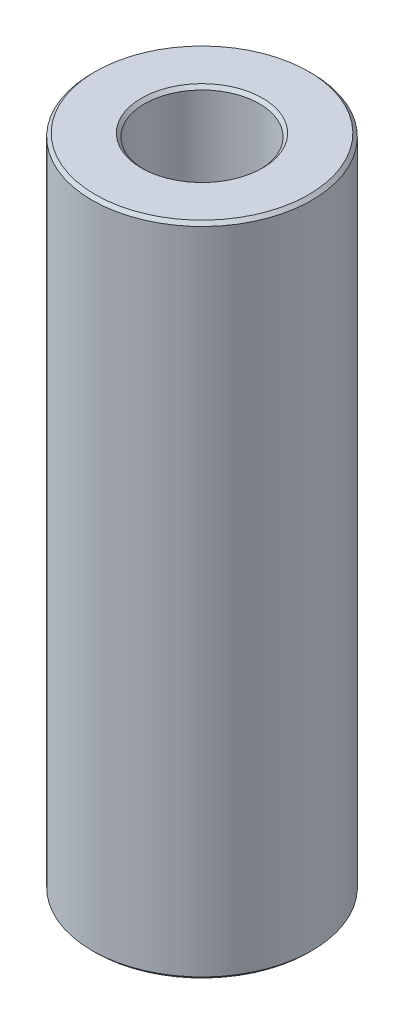
ISO-10303-21;
HEADER;
FILE_DESCRIPTION(('STEP AP214'),'2;1');
FILE_NAME('part.step','',(''),(''),'','','');
FILE_SCHEMA(('AUTOMOTIVE_DESIGN { 1 0 10303 214 1 1 1 1 }'));
ENDSEC;
DATA;
#1=APPLICATION_CONTEXT('core data for automotive mechanical design processes');
#2=APPLICATION_PROTOCOL_DEFINITION('international standard','automotive_design',2000,#1);
#3=PRODUCT_CONTEXT('',#1,'mechanical');
#4=PRODUCT('Part','Part','',(#3));
#5=PRODUCT_RELATED_PRODUCT_CATEGORY('part','',(#4));
#6=PRODUCT_DEFINITION_FORMATION('','',#4);
#7=PRODUCT_DEFINITION_CONTEXT('part definition',#1,'design');
#8=PRODUCT_DEFINITION('design','',#6,#7);
#9=PRODUCT_DEFINITION_SHAPE('','',#8);
#10=(LENGTH_UNIT() NAMED_UNIT(*) SI_UNIT(.MILLI.,.METRE.));
#11=(NAMED_UNIT(*) PLANE_ANGLE_UNIT() SI_UNIT($,.RADIAN.));
#12=(NAMED_UNIT(*) SI_UNIT($,.STERADIAN.) SOLID_ANGLE_UNIT());
#13=UNCERTAINTY_MEASURE_WITH_UNIT(LENGTH_MEASURE(1.E-05),#10,'distance_accuracy_value','');
#14=(GEOMETRIC_REPRESENTATION_CONTEXT(3) GLOBAL_UNCERTAINTY_ASSIGNED_CONTEXT((#13)) GLOBAL_UNIT_ASSIGNED_CONTEXT((#10,
#11,#12)) REPRESENTATION_CONTEXT('',''));
#15=CARTESIAN_POINT('',(0.,0.,0.));
#16=DIRECTION('',(0.,0.,1.));
#17=DIRECTION('',(1.,0.,0.));
#18=AXIS2_PLACEMENT_3D('',#15,#16,#17);
#19=CARTESIAN_POINT('',(0.,223.973092553856,0.));
#20=DIRECTION('',(0.,-1.,0.));
#21=DIRECTION('',(0.,0.,-1.));
#22=AXIS2_PLACEMENT_3D('',#19,#20,#21);
#23=CYLINDRICAL_SURFACE('',#22,37.5);
#24=CARTESIAN_POINT('',(0.,1.09872853246787,0.));
#25=DIRECTION('',(0.,1.,0.));
#26=DIRECTION('',(0.,0.,1.));
#27=AXIS2_PLACEMENT_3D('',#24,#25,#26);
#28=CIRCLE('',#27,37.5);
#29=CARTESIAN_POINT('',(0.,1.09872853246787,37.5));
#30=VERTEX_POINT('',#29);
#31=EDGE_CURVE('E10',#30,#30,#28,.T.);
#32=ORIENTED_EDGE('',*,*,#31,.T.);
#33=EDGE_LOOP('',(#32));
#34=FACE_BOUND('',#33,.T.);
#35=CARTESIAN_POINT('',(0.,222.874364021388,0.));
#36=DIRECTION('',(0.,1.,0.));
#37=DIRECTION('',(0.,0.,1.));
#38=AXIS2_PLACEMENT_3D('',#35,#36,#37);
#39=CIRCLE('',#38,37.5);
#40=CARTESIAN_POINT('',(0.,222.874364021388,37.5));
#41=VERTEX_POINT('',#40);
#42=EDGE_CURVE('E50',#41,#41,#39,.F.);
#43=ORIENTED_EDGE('',*,*,#42,.T.);
#44=EDGE_LOOP('',(#43));
#45=FACE_BOUND('',#44,.T.);
#46=ADVANCED_FACE('F39',(#34,#45),#23,.T.);
#47=CARTESIAN_POINT('',(0.,223.973092553856,0.));
#48=DIRECTION('',(0.,1.,0.));
#49=DIRECTION('',(0.,0.,1.));
#50=AXIS2_PLACEMENT_3D('',#47,#48,#49);
#51=PLANE('',#50);
#52=CARTESIAN_POINT('',(0.,223.973092553856,0.));
#53=DIRECTION('',(0.,1.,0.));
#54=DIRECTION('',(0.,0.,1.));
#55=AXIS2_PLACEMENT_3D('',#52,#53,#54);
#56=CIRCLE('',#55,20.6757530752686);
#57=CARTESIAN_POINT('',(0.,223.973092553856,20.6757530752686));
#58=VERTEX_POINT('',#57);
#59=EDGE_CURVE('E58',#58,#58,#56,.F.);
#60=ORIENTED_EDGE('',*,*,#59,.T.);
#61=EDGE_LOOP('',(#60));
#62=FACE_BOUND('',#61,.T.);
#63=CARTESIAN_POINT('',(0.,223.973092553856,0.));
#64=DIRECTION('',(0.,1.,0.));
#65=DIRECTION('',(0.,0.,1.));
#66=AXIS2_PLACEMENT_3D('',#63,#64,#65);
#67=CIRCLE('',#66,36.4012714675322);
#68=CARTESIAN_POINT('',(0.,223.973092553856,36.4012714675322));
#69=VERTEX_POINT('',#68);
#70=EDGE_CURVE('E61',#69,#69,#67,.T.);
#71=ORIENTED_EDGE('',*,*,#70,.T.);
#72=EDGE_LOOP('',(#71));
#73=FACE_BOUND('',#72,.T.);
#74=ADVANCED_FACE('F88',(#62,#73),#51,.T.);
#75=CARTESIAN_POINT('',(0.,0.,0.));
#76=DIRECTION('',(0.,1.,0.));
#77=DIRECTION('',(0.,0.,1.));
#78=AXIS2_PLACEMENT_3D('',#75,#76,#77);
#79=PLANE('',#78);
#80=CARTESIAN_POINT('',(0.,0.,0.));
#81=DIRECTION('',(0.,1.,0.));
#82=DIRECTION('',(0.,0.,1.));
#83=AXIS2_PLACEMENT_3D('',#80,#81,#82);
#84=CIRCLE('',#83,20.6757530752686);
#85=CARTESIAN_POINT('',(0.,0.,20.6757530752686));
#86=VERTEX_POINT('',#85);
#87=EDGE_CURVE('E51',#86,#86,#84,.T.);
#88=ORIENTED_EDGE('',*,*,#87,.T.);
#89=EDGE_LOOP('',(#88));
#90=FACE_BOUND('',#89,.T.);
#91=CARTESIAN_POINT('',(0.,0.,0.));
#92=DIRECTION('',(0.,1.,0.));
#93=DIRECTION('',(0.,0.,1.));
#94=AXIS2_PLACEMENT_3D('',#91,#92,#93);
#95=CIRCLE('',#94,36.4012714675322);
#96=CARTESIAN_POINT('',(0.,0.,36.4012714675322));
#97=VERTEX_POINT('',#96);
#98=EDGE_CURVE('E54',#97,#97,#95,.F.);
#99=ORIENTED_EDGE('',*,*,#98,.T.);
#100=EDGE_LOOP('',(#99));
#101=FACE_BOUND('',#100,.T.);
#102=ADVANCED_FACE('F83',(#90,#101),#79,.F.);
#103=CARTESIAN_POINT('',(0.,223.973092553856,0.));
#104=DIRECTION('',(0.,-1.,0.));
#105=DIRECTION('',(0.,0.,-1.));
#106=AXIS2_PLACEMENT_3D('',#103,#104,#105);
#107=CYLINDRICAL_SURFACE('',#106,19.5770245428007);
#108=CARTESIAN_POINT('',(0.,222.874364021388,0.));
#109=DIRECTION('',(0.,1.,0.));
#110=DIRECTION('',(0.,0.,1.));
#111=AXIS2_PLACEMENT_3D('',#108,#109,#110);
#112=CIRCLE('',#111,19.5770245428007);
#113=CARTESIAN_POINT('',(0.,222.874364021388,19.5770245428007));
#114=VERTEX_POINT('',#113);
#115=EDGE_CURVE('E67',#114,#114,#112,.T.);
#116=ORIENTED_EDGE('',*,*,#115,.T.);
#117=EDGE_LOOP('',(#116));
#118=FACE_BOUND('',#117,.T.);
#119=CARTESIAN_POINT('',(0.,1.09872853246787,0.));
#120=DIRECTION('',(0.,1.,0.));
#121=DIRECTION('',(0.,0.,1.));
#122=AXIS2_PLACEMENT_3D('',#119,#120,#121);
#123=CIRCLE('',#122,19.5770245428007);
#124=CARTESIAN_POINT('',(0.,1.09872853246787,19.5770245428007));
#125=VERTEX_POINT('',#124);
#126=EDGE_CURVE('E69',#125,#125,#123,.F.);
#127=ORIENTED_EDGE('',*,*,#126,.T.);
#128=EDGE_LOOP('',(#127));
#129=FACE_BOUND('',#128,.T.);
#130=ADVANCED_FACE('F71',(#118,#129),#107,.F.);
#131=CARTESIAN_POINT('',(0.,222.874364021388,0.));
#132=DIRECTION('',(0.,1.,0.));
#133=DIRECTION('',(0.,0.,1.));
#134=AXIS2_PLACEMENT_3D('',#131,#132,#133);
#135=CONICAL_SURFACE('',#134,19.5770245428007,0.785398163397448);
#136=ORIENTED_EDGE('',*,*,#59,.F.);
#137=EDGE_LOOP('',(#136));
#138=FACE_BOUND('',#137,.T.);
#139=ORIENTED_EDGE('',*,*,#115,.F.);
#140=EDGE_LOOP('',(#139));
#141=FACE_BOUND('',#140,.T.);
#142=ADVANCED_FACE('F77',(#138,#141),#135,.F.);
#143=CARTESIAN_POINT('',(0.,0.,0.));
#144=DIRECTION('',(0.,-1.,0.));
#145=DIRECTION('',(0.,0.,-1.));
#146=AXIS2_PLACEMENT_3D('',#143,#144,#145);
#147=CONICAL_SURFACE('',#146,20.6757530752686,0.785398163397436);
#148=ORIENTED_EDGE('',*,*,#126,.F.);
#149=EDGE_LOOP('',(#148));
#150=FACE_BOUND('',#149,.T.);
#151=ORIENTED_EDGE('',*,*,#87,.F.);
#152=EDGE_LOOP('',(#151));
#153=FACE_BOUND('',#152,.T.);
#154=ADVANCED_FACE('F73',(#150,#153),#147,.F.);
#155=CARTESIAN_POINT('',(0.,1.09872853246787,0.));
#156=DIRECTION('',(0.,1.,0.));
#157=DIRECTION('',(0.,0.,1.));
#158=AXIS2_PLACEMENT_3D('',#155,#156,#157);
#159=CONICAL_SURFACE('',#158,37.5,0.785398163397436);
#160=ORIENTED_EDGE('',*,*,#98,.F.);
#161=EDGE_LOOP('',(#160));
#162=FACE_BOUND('',#161,.T.);
#163=ORIENTED_EDGE('',*,*,#31,.F.);
#164=EDGE_LOOP('',(#163));
#165=FACE_BOUND('',#164,.T.);
#166=ADVANCED_FACE('F76',(#162,#165),#159,.T.);
#167=CARTESIAN_POINT('',(0.,223.973092553856,0.));
#168=DIRECTION('',(0.,-1.,0.));
#169=DIRECTION('',(0.,0.,-1.));
#170=AXIS2_PLACEMENT_3D('',#167,#168,#169);
#171=CONICAL_SURFACE('',#170,36.4012714675322,0.785398163397461);
#172=ORIENTED_EDGE('',*,*,#42,.F.);
#173=EDGE_LOOP('',(#172));
#174=FACE_BOUND('',#173,.T.);
#175=ORIENTED_EDGE('',*,*,#70,.F.);
#176=EDGE_LOOP('',(#175));
#177=FACE_BOUND('',#176,.T.);
#178=ADVANCED_FACE('F45',(#174,#177),#171,.T.);
#179=CLOSED_SHELL('',(#46,#74,#102,#130,#142,#154,#166,#178));
#180=MANIFOLD_SOLID_BREP('B2',#179);
#181=ADVANCED_BREP_SHAPE_REPRESENTATION('',(#18,#180),#14);
#182=SHAPE_DEFINITION_REPRESENTATION(#9,#181);
ENDSEC;
END-ISO-10303-21;
